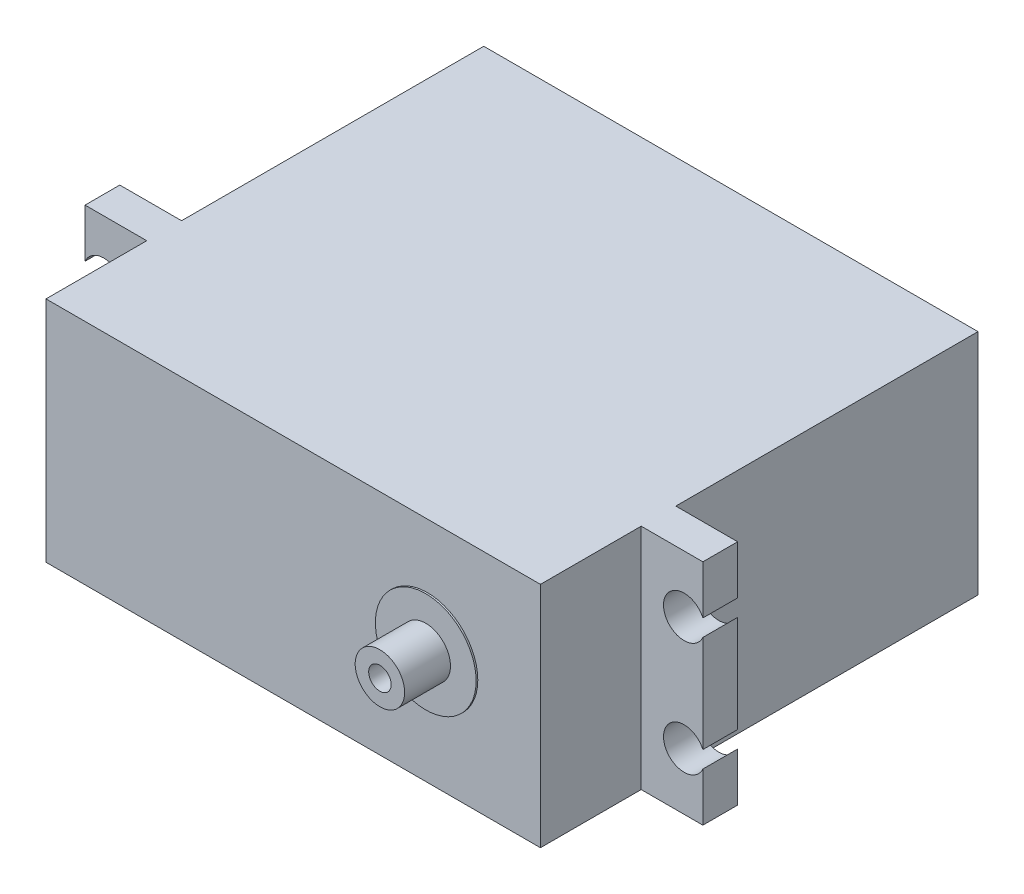
ISO-10303-21;
HEADER;
FILE_DESCRIPTION(('STEP AP214'),'2;1');
FILE_NAME('part.step','',(''),(''),'','','');
FILE_SCHEMA(('AUTOMOTIVE_DESIGN { 1 0 10303 214 1 1 1 1 }'));
ENDSEC;
DATA;
#1=APPLICATION_CONTEXT('core data for automotive mechanical design processes');
#2=APPLICATION_PROTOCOL_DEFINITION('international standard','automotive_design',2000,#1);
#3=PRODUCT_CONTEXT('',#1,'mechanical');
#4=PRODUCT('Part','Part','',(#3));
#5=PRODUCT_RELATED_PRODUCT_CATEGORY('part','',(#4));
#6=PRODUCT_DEFINITION_FORMATION('','',#4);
#7=PRODUCT_DEFINITION_CONTEXT('part definition',#1,'design');
#8=PRODUCT_DEFINITION('design','',#6,#7);
#9=PRODUCT_DEFINITION_SHAPE('','',#8);
#10=(LENGTH_UNIT() NAMED_UNIT(*) SI_UNIT(.MILLI.,.METRE.));
#11=(NAMED_UNIT(*) PLANE_ANGLE_UNIT() SI_UNIT($,.RADIAN.));
#12=(NAMED_UNIT(*) SI_UNIT($,.STERADIAN.) SOLID_ANGLE_UNIT());
#13=UNCERTAINTY_MEASURE_WITH_UNIT(LENGTH_MEASURE(1.E-05),#10,'distance_accuracy_value','');
#14=(GEOMETRIC_REPRESENTATION_CONTEXT(3) GLOBAL_UNCERTAINTY_ASSIGNED_CONTEXT((#13)) GLOBAL_UNIT_ASSIGNED_CONTEXT((#10,
#11,#12)) REPRESENTATION_CONTEXT('',''));
#15=CARTESIAN_POINT('',(0.,0.,0.));
#16=DIRECTION('',(0.,0.,1.));
#17=DIRECTION('',(1.,0.,0.));
#18=AXIS2_PLACEMENT_3D('',#15,#16,#17);
#19=CARTESIAN_POINT('',(0.,0.,45.0154));
#20=DIRECTION('',(0.,0.,1.));
#21=DIRECTION('',(1.,0.,0.));
#22=AXIS2_PLACEMENT_3D('',#19,#20,#21);
#23=PLANE('',#22);
#24=DIRECTION('',(0.,-1.,0.));
#25=VECTOR('',#24,1.);
#26=CARTESIAN_POINT('',(-33.03236,-15.24,45.0154));
#27=LINE('',#26,#25);
#28=CARTESIAN_POINT('',(-33.03236,15.24,45.0154));
#29=VERTEX_POINT('',#28);
#30=CARTESIAN_POINT('',(-33.03236,-15.24,45.0154));
#31=VERTEX_POINT('',#30);
#32=EDGE_CURVE('E194',#29,#31,#27,.T.);
#33=ORIENTED_EDGE('',*,*,#32,.F.);
#34=DIRECTION('',(-1.,0.,0.));
#35=VECTOR('',#34,1.);
#36=CARTESIAN_POINT('',(0.,15.24,45.0154));
#37=LINE('',#36,#35);
#38=CARTESIAN_POINT('',(-41.275,15.24,45.0154));
#39=VERTEX_POINT('',#38);
#40=EDGE_CURVE('E505',#29,#39,#37,.T.);
#41=ORIENTED_EDGE('',*,*,#40,.T.);
#42=DIRECTION('',(0.,1.,0.));
#43=VECTOR('',#42,1.);
#44=CARTESIAN_POINT('',(-41.275,0.,45.0154));
#45=LINE('',#44,#43);
#46=CARTESIAN_POINT('',(-41.275,8.74168445002051,45.0154));
#47=VERTEX_POINT('',#46);
#48=EDGE_CURVE('E513',#47,#39,#45,.T.);
#49=ORIENTED_EDGE('',*,*,#48,.F.);
#50=CARTESIAN_POINT('',(-38.76612,7.61562,45.0154));
#51=DIRECTION('',(0.,0.,1.));
#52=DIRECTION('',(1.,0.,0.));
#53=AXIS2_PLACEMENT_3D('',#50,#51,#52);
#54=CIRCLE('',#53,2.75);
#55=CARTESIAN_POINT('',(-41.275,6.48955554997949,45.0154));
#56=VERTEX_POINT('',#55);
#57=EDGE_CURVE('E525',#47,#56,#54,.F.);
#58=ORIENTED_EDGE('',*,*,#57,.T.);
#59=DIRECTION('',(0.,-1.,0.));
#60=VECTOR('',#59,1.);
#61=CARTESIAN_POINT('',(-41.275,0.,45.0154));
#62=LINE('',#61,#60);
#63=CARTESIAN_POINT('',(-41.275,-6.48955554997949,45.0154));
#64=VERTEX_POINT('',#63);
#65=EDGE_CURVE('E527',#56,#64,#62,.T.);
#66=ORIENTED_EDGE('',*,*,#65,.T.);
#67=CARTESIAN_POINT('',(-38.76612,-7.61562,45.0154));
#68=DIRECTION('',(0.,0.,1.));
#69=DIRECTION('',(1.,0.,0.));
#70=AXIS2_PLACEMENT_3D('',#67,#68,#69);
#71=CIRCLE('',#70,2.75);
#72=CARTESIAN_POINT('',(-41.275,-8.74168445002051,45.0154));
#73=VERTEX_POINT('',#72);
#74=EDGE_CURVE('E529',#73,#64,#71,.T.);
#75=ORIENTED_EDGE('',*,*,#74,.F.);
#76=DIRECTION('',(0.,-1.,0.));
#77=VECTOR('',#76,1.);
#78=CARTESIAN_POINT('',(-41.275,0.,45.0154));
#79=LINE('',#78,#77);
#80=CARTESIAN_POINT('',(-41.275,-15.24,45.0154));
#81=VERTEX_POINT('',#80);
#82=EDGE_CURVE('E532',#73,#81,#79,.T.);
#83=ORIENTED_EDGE('',*,*,#82,.T.);
#84=DIRECTION('',(-1.,0.,0.));
#85=VECTOR('',#84,1.);
#86=CARTESIAN_POINT('',(0.,-15.24,45.0154));
#87=LINE('',#86,#85);
#88=EDGE_CURVE('E50',#31,#81,#87,.T.);
#89=ORIENTED_EDGE('',*,*,#88,.F.);
#90=EDGE_LOOP('',(#33,#41,#49,#58,#66,#75,#83,#89));
#91=FACE_BOUND('',#90,.T.);
#92=ADVANCED_FACE('F35',(#91),#23,.T.);
#93=CARTESIAN_POINT('',(-33.02,-15.24,40.3754));
#94=DIRECTION('',(1.,0.,0.));
#95=DIRECTION('',(0.,0.,-1.));
#96=AXIS2_PLACEMENT_3D('',#93,#94,#95);
#97=PLANE('',#96);
#98=DIRECTION('',(0.,-1.,0.));
#99=VECTOR('',#98,1.);
#100=CARTESIAN_POINT('',(-33.02,-15.24,0.));
#101=LINE('',#100,#99);
#102=CARTESIAN_POINT('',(-33.02,15.24,0.));
#103=VERTEX_POINT('',#102);
#104=CARTESIAN_POINT('',(-33.02,-15.24,0.));
#105=VERTEX_POINT('',#104);
#106=EDGE_CURVE('E593',#103,#105,#101,.T.);
#107=ORIENTED_EDGE('',*,*,#106,.T.);
#108=DIRECTION('',(0.,0.,-1.));
#109=VECTOR('',#108,1.);
#110=CARTESIAN_POINT('',(-33.02,-15.24,40.3754));
#111=LINE('',#110,#109);
#112=CARTESIAN_POINT('',(-33.02,-15.24,40.3754));
#113=VERTEX_POINT('',#112);
#114=EDGE_CURVE('E43',#113,#105,#111,.T.);
#115=ORIENTED_EDGE('',*,*,#114,.F.);
#116=DIRECTION('',(0.,-1.,0.));
#117=VECTOR('',#116,1.);
#118=CARTESIAN_POINT('',(-33.02,-15.24,40.3754));
#119=LINE('',#118,#117);
#120=CARTESIAN_POINT('',(-33.02,15.24,40.3754));
#121=VERTEX_POINT('',#120);
#122=EDGE_CURVE('E609',#121,#113,#119,.T.);
#123=ORIENTED_EDGE('',*,*,#122,.F.);
#124=DIRECTION('',(0.,0.,-1.));
#125=VECTOR('',#124,1.);
#126=CARTESIAN_POINT('',(-33.02,15.24,40.3754));
#127=LINE('',#126,#125);
#128=EDGE_CURVE('E614',#121,#103,#127,.T.);
#129=ORIENTED_EDGE('',*,*,#128,.T.);
#130=EDGE_LOOP('',(#107,#115,#123,#129));
#131=FACE_BOUND('',#130,.T.);
#132=ADVANCED_FACE('F37',(#131),#97,.F.);
#133=CARTESIAN_POINT('',(33.02,-15.24,40.3754));
#134=DIRECTION('',(0.,1.,0.));
#135=DIRECTION('',(-1.,0.,0.));
#136=AXIS2_PLACEMENT_3D('',#133,#134,#135);
#137=PLANE('',#136);
#138=DIRECTION('',(1.,0.,0.));
#139=VECTOR('',#138,1.);
#140=CARTESIAN_POINT('',(33.02,-15.24,0.));
#141=LINE('',#140,#139);
#142=CARTESIAN_POINT('',(33.02,-15.24,0.));
#143=VERTEX_POINT('',#142);
#144=EDGE_CURVE('E597',#105,#143,#141,.T.);
#145=ORIENTED_EDGE('',*,*,#144,.T.);
#146=DIRECTION('',(0.,0.,-1.));
#147=VECTOR('',#146,1.);
#148=CARTESIAN_POINT('',(33.02,-15.24,40.3754));
#149=LINE('',#148,#147);
#150=CARTESIAN_POINT('',(33.02,-15.24,40.3754));
#151=VERTEX_POINT('',#150);
#152=EDGE_CURVE('E613',#151,#143,#149,.T.);
#153=ORIENTED_EDGE('',*,*,#152,.F.);
#154=DIRECTION('',(-1.,0.,0.));
#155=VECTOR('',#154,1.);
#156=CARTESIAN_POINT('',(0.,-15.24,40.3754));
#157=LINE('',#156,#155);
#158=CARTESIAN_POINT('',(41.275,-15.24,40.3754));
#159=VERTEX_POINT('',#158);
#160=EDGE_CURVE('E561',#159,#151,#157,.T.);
#161=ORIENTED_EDGE('',*,*,#160,.F.);
#162=DIRECTION('',(0.,0.,-1.));
#163=VECTOR('',#162,1.);
#164=CARTESIAN_POINT('',(41.275,-15.24,45.0154));
#165=LINE('',#164,#163);
#166=CARTESIAN_POINT('',(41.275,-15.24,45.0154));
#167=VERTEX_POINT('',#166);
#168=EDGE_CURVE('E568',#167,#159,#165,.T.);
#169=ORIENTED_EDGE('',*,*,#168,.F.);
#170=CARTESIAN_POINT('',(33.03236,-15.24,45.0154));
#171=VERTEX_POINT('',#170);
#172=EDGE_CURVE('E519',#167,#171,#87,.T.);
#173=ORIENTED_EDGE('',*,*,#172,.T.);
#174=DIRECTION('',(0.,0.,-1.));
#175=VECTOR('',#174,1.);
#176=CARTESIAN_POINT('',(33.03236,-15.24,58.4774));
#177=LINE('',#176,#175);
#178=CARTESIAN_POINT('',(33.03236,-15.24,58.4774));
#179=VERTEX_POINT('',#178);
#180=EDGE_CURVE('E179',#179,#171,#177,.T.);
#181=ORIENTED_EDGE('',*,*,#180,.F.);
#182=DIRECTION('',(1.,0.,0.));
#183=VECTOR('',#182,1.);
#184=CARTESIAN_POINT('',(33.03236,-15.24,58.4774));
#185=LINE('',#184,#183);
#186=CARTESIAN_POINT('',(-33.03236,-15.24,58.4774));
#187=VERTEX_POINT('',#186);
#188=EDGE_CURVE('E172',#187,#179,#185,.T.);
#189=ORIENTED_EDGE('',*,*,#188,.F.);
#190=DIRECTION('',(0.,0.,-1.));
#191=VECTOR('',#190,1.);
#192=CARTESIAN_POINT('',(-33.03236,-15.24,58.4774));
#193=LINE('',#192,#191);
#194=EDGE_CURVE('E176',#187,#31,#193,.T.);
#195=ORIENTED_EDGE('',*,*,#194,.T.);
#196=ORIENTED_EDGE('',*,*,#88,.T.);
#197=DIRECTION('',(0.,0.,-1.));
#198=VECTOR('',#197,1.);
#199=CARTESIAN_POINT('',(-41.275,-15.24,45.0154));
#200=LINE('',#199,#198);
#201=CARTESIAN_POINT('',(-41.275,-15.24,40.3754));
#202=VERTEX_POINT('',#201);
#203=EDGE_CURVE('E571',#81,#202,#200,.T.);
#204=ORIENTED_EDGE('',*,*,#203,.T.);
#205=EDGE_CURVE('E558',#113,#202,#157,.T.);
#206=ORIENTED_EDGE('',*,*,#205,.F.);
#207=ORIENTED_EDGE('',*,*,#114,.T.);
#208=EDGE_LOOP('',(#145,#153,#161,#169,#173,#181,#189,#195,#196,#204,#206,#207));
#209=FACE_BOUND('',#208,.T.);
#210=ADVANCED_FACE('F174',(#209),#137,.F.);
#211=CARTESIAN_POINT('',(33.02,-15.24,40.3754));
#212=DIRECTION('',(-1.,0.,0.));
#213=DIRECTION('',(0.,0.,1.));
#214=AXIS2_PLACEMENT_3D('',#211,#212,#213);
#215=PLANE('',#214);
#216=DIRECTION('',(0.,1.,0.));
#217=VECTOR('',#216,1.);
#218=CARTESIAN_POINT('',(33.02,-15.24,0.));
#219=LINE('',#218,#217);
#220=CARTESIAN_POINT('',(33.02,15.24,0.));
#221=VERTEX_POINT('',#220);
#222=EDGE_CURVE('E601',#143,#221,#219,.T.);
#223=ORIENTED_EDGE('',*,*,#222,.T.);
#224=DIRECTION('',(0.,0.,-1.));
#225=VECTOR('',#224,1.);
#226=CARTESIAN_POINT('',(33.02,15.24,40.3754));
#227=LINE('',#226,#225);
#228=CARTESIAN_POINT('',(33.02,15.24,40.3754));
#229=VERTEX_POINT('',#228);
#230=EDGE_CURVE('E610',#229,#221,#227,.T.);
#231=ORIENTED_EDGE('',*,*,#230,.F.);
#232=DIRECTION('',(0.,1.,0.));
#233=VECTOR('',#232,1.);
#234=CARTESIAN_POINT('',(33.02,-15.24,40.3754));
#235=LINE('',#234,#233);
#236=EDGE_CURVE('E617',#151,#229,#235,.T.);
#237=ORIENTED_EDGE('',*,*,#236,.F.);
#238=ORIENTED_EDGE('',*,*,#152,.T.);
#239=EDGE_LOOP('',(#223,#231,#237,#238));
#240=FACE_BOUND('',#239,.T.);
#241=ADVANCED_FACE('F332',(#240),#215,.F.);
#242=CARTESIAN_POINT('',(33.02,15.24,40.3754));
#243=DIRECTION('',(0.,-1.,0.));
#244=DIRECTION('',(1.,0.,0.));
#245=AXIS2_PLACEMENT_3D('',#242,#243,#244);
#246=PLANE('',#245);
#247=DIRECTION('',(-1.,0.,0.));
#248=VECTOR('',#247,1.);
#249=CARTESIAN_POINT('',(33.02,15.24,0.));
#250=LINE('',#249,#248);
#251=EDGE_CURVE('E607',#221,#103,#250,.T.);
#252=ORIENTED_EDGE('',*,*,#251,.T.);
#253=ORIENTED_EDGE('',*,*,#128,.F.);
#254=DIRECTION('',(-1.,0.,0.));
#255=VECTOR('',#254,1.);
#256=CARTESIAN_POINT('',(0.,15.24,40.3754));
#257=LINE('',#256,#255);
#258=CARTESIAN_POINT('',(-41.275,15.24,40.3754));
#259=VERTEX_POINT('',#258);
#260=EDGE_CURVE('E546',#121,#259,#257,.T.);
#261=ORIENTED_EDGE('',*,*,#260,.T.);
#262=DIRECTION('',(0.,0.,-1.));
#263=VECTOR('',#262,1.);
#264=CARTESIAN_POINT('',(-41.275,15.24,45.0154));
#265=LINE('',#264,#263);
#266=EDGE_CURVE('E507',#39,#259,#265,.T.);
#267=ORIENTED_EDGE('',*,*,#266,.F.);
#268=ORIENTED_EDGE('',*,*,#40,.F.);
#269=DIRECTION('',(0.,0.,-1.));
#270=VECTOR('',#269,1.);
#271=CARTESIAN_POINT('',(-33.03236,15.24,58.4774));
#272=LINE('',#271,#270);
#273=CARTESIAN_POINT('',(-33.03236,15.24,58.4774));
#274=VERTEX_POINT('',#273);
#275=EDGE_CURVE('E210',#274,#29,#272,.T.);
#276=ORIENTED_EDGE('',*,*,#275,.F.);
#277=DIRECTION('',(-1.,0.,0.));
#278=VECTOR('',#277,1.);
#279=CARTESIAN_POINT('',(33.03236,15.24,58.4774));
#280=LINE('',#279,#278);
#281=CARTESIAN_POINT('',(33.03236,15.24,58.4774));
#282=VERTEX_POINT('',#281);
#283=EDGE_CURVE('E188',#282,#274,#280,.T.);
#284=ORIENTED_EDGE('',*,*,#283,.F.);
#285=DIRECTION('',(0.,0.,-1.));
#286=VECTOR('',#285,1.);
#287=CARTESIAN_POINT('',(33.03236,15.24,58.4774));
#288=LINE('',#287,#286);
#289=CARTESIAN_POINT('',(33.03236,15.24,45.0154));
#290=VERTEX_POINT('',#289);
#291=EDGE_CURVE('E200',#282,#290,#288,.T.);
#292=ORIENTED_EDGE('',*,*,#291,.T.);
#293=CARTESIAN_POINT('',(41.275,15.24,45.0154));
#294=VERTEX_POINT('',#293);
#295=EDGE_CURVE('E510',#294,#290,#37,.T.);
#296=ORIENTED_EDGE('',*,*,#295,.F.);
#297=DIRECTION('',(0.,0.,-1.));
#298=VECTOR('',#297,1.);
#299=CARTESIAN_POINT('',(41.275,15.24,45.0154));
#300=LINE('',#299,#298);
#301=CARTESIAN_POINT('',(41.275,15.24,40.3754));
#302=VERTEX_POINT('',#301);
#303=EDGE_CURVE('E584',#294,#302,#300,.T.);
#304=ORIENTED_EDGE('',*,*,#303,.T.);
#305=EDGE_CURVE('E555',#302,#229,#257,.T.);
#306=ORIENTED_EDGE('',*,*,#305,.T.);
#307=ORIENTED_EDGE('',*,*,#230,.T.);
#308=EDGE_LOOP('',(#252,#253,#261,#267,#268,#276,#284,#292,#296,#304,#306,#307));
#309=FACE_BOUND('',#308,.T.);
#310=ADVANCED_FACE('F328',(#309),#246,.F.);
#311=CARTESIAN_POINT('',(0.,0.,0.));
#312=DIRECTION('',(0.,0.,1.));
#313=DIRECTION('',(1.,0.,0.));
#314=AXIS2_PLACEMENT_3D('',#311,#312,#313);
#315=PLANE('',#314);
#316=ORIENTED_EDGE('',*,*,#106,.F.);
#317=ORIENTED_EDGE('',*,*,#251,.F.);
#318=ORIENTED_EDGE('',*,*,#222,.F.);
#319=ORIENTED_EDGE('',*,*,#144,.F.);
#320=EDGE_LOOP('',(#316,#317,#318,#319));
#321=FACE_BOUND('',#320,.T.);
#322=ADVANCED_FACE('F325',(#321),#315,.F.);
#323=CARTESIAN_POINT('',(0.,0.,40.3754));
#324=DIRECTION('',(0.,0.,1.));
#325=DIRECTION('',(1.,0.,0.));
#326=AXIS2_PLACEMENT_3D('',#323,#324,#325);
#327=PLANE('',#326);
#328=ORIENTED_EDGE('',*,*,#260,.F.);
#329=ORIENTED_EDGE('',*,*,#122,.T.);
#330=ORIENTED_EDGE('',*,*,#205,.T.);
#331=DIRECTION('',(0.,-1.,0.));
#332=VECTOR('',#331,1.);
#333=CARTESIAN_POINT('',(-41.275,0.,40.3754));
#334=LINE('',#333,#332);
#335=CARTESIAN_POINT('',(-41.275,-8.74168445002051,40.3754));
#336=VERTEX_POINT('',#335);
#337=EDGE_CURVE('E562',#336,#202,#334,.T.);
#338=ORIENTED_EDGE('',*,*,#337,.F.);
#339=CARTESIAN_POINT('',(-38.76612,-7.61562,40.3754));
#340=DIRECTION('',(0.,0.,1.));
#341=DIRECTION('',(1.,0.,0.));
#342=AXIS2_PLACEMENT_3D('',#339,#340,#341);
#343=CIRCLE('',#342,2.75);
#344=CARTESIAN_POINT('',(-41.275,-6.48955554997949,40.3754));
#345=VERTEX_POINT('',#344);
#346=EDGE_CURVE('E674',#336,#345,#343,.T.);
#347=ORIENTED_EDGE('',*,*,#346,.T.);
#348=DIRECTION('',(0.,-1.,0.));
#349=VECTOR('',#348,1.);
#350=CARTESIAN_POINT('',(-41.275,0.,40.3754));
#351=LINE('',#350,#349);
#352=CARTESIAN_POINT('',(-41.275,6.48955554997949,40.3754));
#353=VERTEX_POINT('',#352);
#354=EDGE_CURVE('E649',#353,#345,#351,.T.);
#355=ORIENTED_EDGE('',*,*,#354,.F.);
#356=CARTESIAN_POINT('',(-38.76612,7.61562,40.3754));
#357=DIRECTION('',(0.,0.,1.));
#358=DIRECTION('',(1.,0.,0.));
#359=AXIS2_PLACEMENT_3D('',#356,#357,#358);
#360=CIRCLE('',#359,2.75);
#361=CARTESIAN_POINT('',(-41.275,8.74168445002051,40.3754));
#362=VERTEX_POINT('',#361);
#363=EDGE_CURVE('E646',#362,#353,#360,.F.);
#364=ORIENTED_EDGE('',*,*,#363,.F.);
#365=DIRECTION('',(0.,1.,0.));
#366=VECTOR('',#365,1.);
#367=CARTESIAN_POINT('',(-41.275,0.,40.3754));
#368=LINE('',#367,#366);
#369=EDGE_CURVE('E549',#362,#259,#368,.T.);
#370=ORIENTED_EDGE('',*,*,#369,.T.);
#371=EDGE_LOOP('',(#328,#329,#330,#338,#347,#355,#364,#370));
#372=FACE_BOUND('',#371,.T.);
#373=ADVANCED_FACE('F291',(#372),#327,.F.);
#374=ORIENTED_EDGE('',*,*,#160,.T.);
#375=ORIENTED_EDGE('',*,*,#236,.T.);
#376=ORIENTED_EDGE('',*,*,#305,.F.);
#377=DIRECTION('',(0.,1.,0.));
#378=VECTOR('',#377,1.);
#379=CARTESIAN_POINT('',(41.275,0.,40.3754));
#380=LINE('',#379,#378);
#381=CARTESIAN_POINT('',(41.275,8.7416844500205,40.3754));
#382=VERTEX_POINT('',#381);
#383=EDGE_CURVE('E544',#382,#302,#380,.T.);
#384=ORIENTED_EDGE('',*,*,#383,.F.);
#385=CARTESIAN_POINT('',(38.76612,7.61562000000001,40.3754));
#386=DIRECTION('',(0.,0.,1.));
#387=DIRECTION('',(1.,0.,0.));
#388=AXIS2_PLACEMENT_3D('',#385,#386,#387);
#389=CIRCLE('',#388,2.75);
#390=CARTESIAN_POINT('',(41.275,6.4895555499795,40.3754));
#391=VERTEX_POINT('',#390);
#392=EDGE_CURVE('E541',#382,#391,#389,.T.);
#393=ORIENTED_EDGE('',*,*,#392,.T.);
#394=DIRECTION('',(0.,-1.,0.));
#395=VECTOR('',#394,1.);
#396=CARTESIAN_POINT('',(41.275,0.,40.3754));
#397=LINE('',#396,#395);
#398=CARTESIAN_POINT('',(41.275,-6.4895555499795,40.3754));
#399=VERTEX_POINT('',#398);
#400=EDGE_CURVE('E538',#391,#399,#397,.T.);
#401=ORIENTED_EDGE('',*,*,#400,.T.);
#402=CARTESIAN_POINT('',(38.76612,-7.61562000000001,40.3754));
#403=DIRECTION('',(0.,0.,1.));
#404=DIRECTION('',(1.,0.,0.));
#405=AXIS2_PLACEMENT_3D('',#402,#403,#404);
#406=CIRCLE('',#405,2.75);
#407=CARTESIAN_POINT('',(41.275,-8.7416844500205,40.3754));
#408=VERTEX_POINT('',#407);
#409=EDGE_CURVE('E198',#408,#399,#406,.F.);
#410=ORIENTED_EDGE('',*,*,#409,.F.);
#411=DIRECTION('',(0.,-1.,0.));
#412=VECTOR('',#411,1.);
#413=CARTESIAN_POINT('',(41.275,0.,40.3754));
#414=LINE('',#413,#412);
#415=EDGE_CURVE('E195',#408,#159,#414,.T.);
#416=ORIENTED_EDGE('',*,*,#415,.T.);
#417=EDGE_LOOP('',(#374,#375,#376,#384,#393,#401,#410,#416));
#418=FACE_BOUND('',#417,.T.);
#419=ADVANCED_FACE('F323',(#418),#327,.F.);
#420=CARTESIAN_POINT('',(41.275,0.,45.0154));
#421=DIRECTION('',(1.,0.,0.));
#422=DIRECTION('',(0.,0.,-1.));
#423=AXIS2_PLACEMENT_3D('',#420,#421,#422);
#424=PLANE('',#423);
#425=ORIENTED_EDGE('',*,*,#415,.F.);
#426=DIRECTION('',(0.,0.,-1.));
#427=VECTOR('',#426,1.);
#428=CARTESIAN_POINT('',(41.275,-8.7416844500205,45.0154));
#429=LINE('',#428,#427);
#430=CARTESIAN_POINT('',(41.275,-8.7416844500205,45.0154));
#431=VERTEX_POINT('',#430);
#432=EDGE_CURVE('E592',#431,#408,#429,.T.);
#433=ORIENTED_EDGE('',*,*,#432,.F.);
#434=DIRECTION('',(0.,-1.,0.));
#435=VECTOR('',#434,1.);
#436=CARTESIAN_POINT('',(41.275,0.,45.0154));
#437=LINE('',#436,#435);
#438=EDGE_CURVE('E217',#431,#167,#437,.T.);
#439=ORIENTED_EDGE('',*,*,#438,.T.);
#440=ORIENTED_EDGE('',*,*,#168,.T.);
#441=EDGE_LOOP('',(#425,#433,#439,#440));
#442=FACE_BOUND('',#441,.T.);
#443=ADVANCED_FACE('F319',(#442),#424,.T.);
#444=CARTESIAN_POINT('',(38.76612,-7.61562000000001,45.0154));
#445=DIRECTION('',(0.,0.,-1.));
#446=DIRECTION('',(-1.,0.,0.));
#447=AXIS2_PLACEMENT_3D('',#444,#445,#446);
#448=CYLINDRICAL_SURFACE('',#447,2.75);
#449=ORIENTED_EDGE('',*,*,#409,.T.);
#450=DIRECTION('',(0.,0.,-1.));
#451=VECTOR('',#450,1.);
#452=CARTESIAN_POINT('',(41.275,-6.4895555499795,45.0154));
#453=LINE('',#452,#451);
#454=CARTESIAN_POINT('',(41.275,-6.4895555499795,45.0154));
#455=VERTEX_POINT('',#454);
#456=EDGE_CURVE('E591',#455,#399,#453,.T.);
#457=ORIENTED_EDGE('',*,*,#456,.F.);
#458=CARTESIAN_POINT('',(38.76612,-7.61562000000001,45.0154));
#459=DIRECTION('',(0.,0.,1.));
#460=DIRECTION('',(1.,0.,0.));
#461=AXIS2_PLACEMENT_3D('',#458,#459,#460);
#462=CIRCLE('',#461,2.75);
#463=EDGE_CURVE('E658',#431,#455,#462,.F.);
#464=ORIENTED_EDGE('',*,*,#463,.F.);
#465=ORIENTED_EDGE('',*,*,#432,.T.);
#466=EDGE_LOOP('',(#449,#457,#464,#465));
#467=FACE_BOUND('',#466,.T.);
#468=ADVANCED_FACE('F315',(#467),#448,.F.);
#469=CARTESIAN_POINT('',(41.275,0.,45.0154));
#470=DIRECTION('',(1.,0.,0.));
#471=DIRECTION('',(0.,0.,-1.));
#472=AXIS2_PLACEMENT_3D('',#469,#470,#471);
#473=PLANE('',#472);
#474=ORIENTED_EDGE('',*,*,#400,.F.);
#475=DIRECTION('',(0.,0.,-1.));
#476=VECTOR('',#475,1.);
#477=CARTESIAN_POINT('',(41.275,6.4895555499795,45.0154));
#478=LINE('',#477,#476);
#479=CARTESIAN_POINT('',(41.275,6.4895555499795,45.0154));
#480=VERTEX_POINT('',#479);
#481=EDGE_CURVE('E589',#480,#391,#478,.T.);
#482=ORIENTED_EDGE('',*,*,#481,.F.);
#483=DIRECTION('',(0.,-1.,0.));
#484=VECTOR('',#483,1.);
#485=CARTESIAN_POINT('',(41.275,0.,45.0154));
#486=LINE('',#485,#484);
#487=EDGE_CURVE('E660',#480,#455,#486,.T.);
#488=ORIENTED_EDGE('',*,*,#487,.T.);
#489=ORIENTED_EDGE('',*,*,#456,.T.);
#490=EDGE_LOOP('',(#474,#482,#488,#489));
#491=FACE_BOUND('',#490,.T.);
#492=ADVANCED_FACE('F311',(#491),#473,.T.);
#493=CARTESIAN_POINT('',(38.76612,7.61562000000001,45.0154));
#494=DIRECTION('',(0.,0.,-1.));
#495=DIRECTION('',(-1.,0.,0.));
#496=AXIS2_PLACEMENT_3D('',#493,#494,#495);
#497=CYLINDRICAL_SURFACE('',#496,2.75);
#498=ORIENTED_EDGE('',*,*,#392,.F.);
#499=DIRECTION('',(0.,0.,-1.));
#500=VECTOR('',#499,1.);
#501=CARTESIAN_POINT('',(41.275,8.7416844500205,45.0154));
#502=LINE('',#501,#500);
#503=CARTESIAN_POINT('',(41.275,8.7416844500205,45.0154));
#504=VERTEX_POINT('',#503);
#505=EDGE_CURVE('E587',#504,#382,#502,.T.);
#506=ORIENTED_EDGE('',*,*,#505,.F.);
#507=CARTESIAN_POINT('',(38.76612,7.61562000000001,45.0154));
#508=DIRECTION('',(0.,0.,1.));
#509=DIRECTION('',(1.,0.,0.));
#510=AXIS2_PLACEMENT_3D('',#507,#508,#509);
#511=CIRCLE('',#510,2.75);
#512=EDGE_CURVE('E515',#504,#480,#511,.T.);
#513=ORIENTED_EDGE('',*,*,#512,.T.);
#514=ORIENTED_EDGE('',*,*,#481,.T.);
#515=EDGE_LOOP('',(#498,#506,#513,#514));
#516=FACE_BOUND('',#515,.T.);
#517=ADVANCED_FACE('F307',(#516),#497,.F.);
#518=CARTESIAN_POINT('',(41.275,0.,45.0154));
#519=DIRECTION('',(-1.,0.,0.));
#520=DIRECTION('',(0.,0.,1.));
#521=AXIS2_PLACEMENT_3D('',#518,#519,#520);
#522=PLANE('',#521);
#523=ORIENTED_EDGE('',*,*,#383,.T.);
#524=ORIENTED_EDGE('',*,*,#303,.F.);
#525=DIRECTION('',(0.,1.,0.));
#526=VECTOR('',#525,1.);
#527=CARTESIAN_POINT('',(41.275,0.,45.0154));
#528=LINE('',#527,#526);
#529=EDGE_CURVE('E511',#504,#294,#528,.T.);
#530=ORIENTED_EDGE('',*,*,#529,.F.);
#531=ORIENTED_EDGE('',*,*,#505,.T.);
#532=EDGE_LOOP('',(#523,#524,#530,#531));
#533=FACE_BOUND('',#532,.T.);
#534=ADVANCED_FACE('F303',(#533),#522,.F.);
#535=CARTESIAN_POINT('',(-41.275,0.,45.0154));
#536=DIRECTION('',(-1.,0.,0.));
#537=DIRECTION('',(0.,0.,1.));
#538=AXIS2_PLACEMENT_3D('',#535,#536,#537);
#539=PLANE('',#538);
#540=ORIENTED_EDGE('',*,*,#369,.F.);
#541=DIRECTION('',(0.,0.,-1.));
#542=VECTOR('',#541,1.);
#543=CARTESIAN_POINT('',(-41.275,8.74168445002051,45.0154));
#544=LINE('',#543,#542);
#545=EDGE_CURVE('E581',#47,#362,#544,.T.);
#546=ORIENTED_EDGE('',*,*,#545,.F.);
#547=ORIENTED_EDGE('',*,*,#48,.T.);
#548=ORIENTED_EDGE('',*,*,#266,.T.);
#549=EDGE_LOOP('',(#540,#546,#547,#548));
#550=FACE_BOUND('',#549,.T.);
#551=ADVANCED_FACE('F299',(#550),#539,.T.);
#552=CARTESIAN_POINT('',(-38.76612,7.61562,45.0154));
#553=DIRECTION('',(0.,0.,-1.));
#554=DIRECTION('',(-1.,0.,0.));
#555=AXIS2_PLACEMENT_3D('',#552,#553,#554);
#556=CYLINDRICAL_SURFACE('',#555,2.75);
#557=ORIENTED_EDGE('',*,*,#363,.T.);
#558=DIRECTION('',(0.,0.,-1.));
#559=VECTOR('',#558,1.);
#560=CARTESIAN_POINT('',(-41.275,6.48955554997949,45.0154));
#561=LINE('',#560,#559);
#562=EDGE_CURVE('E578',#56,#353,#561,.T.);
#563=ORIENTED_EDGE('',*,*,#562,.F.);
#564=ORIENTED_EDGE('',*,*,#57,.F.);
#565=ORIENTED_EDGE('',*,*,#545,.T.);
#566=EDGE_LOOP('',(#557,#563,#564,#565));
#567=FACE_BOUND('',#566,.T.);
#568=ADVANCED_FACE('F295',(#567),#556,.F.);
#569=CARTESIAN_POINT('',(-41.275,0.,45.0154));
#570=DIRECTION('',(1.,0.,0.));
#571=DIRECTION('',(0.,0.,-1.));
#572=AXIS2_PLACEMENT_3D('',#569,#570,#571);
#573=PLANE('',#572);
#574=ORIENTED_EDGE('',*,*,#354,.T.);
#575=DIRECTION('',(0.,0.,-1.));
#576=VECTOR('',#575,1.);
#577=CARTESIAN_POINT('',(-41.275,-6.48955554997949,45.0154));
#578=LINE('',#577,#576);
#579=EDGE_CURVE('E576',#64,#345,#578,.T.);
#580=ORIENTED_EDGE('',*,*,#579,.F.);
#581=ORIENTED_EDGE('',*,*,#65,.F.);
#582=ORIENTED_EDGE('',*,*,#562,.T.);
#583=EDGE_LOOP('',(#574,#580,#581,#582));
#584=FACE_BOUND('',#583,.T.);
#585=ADVANCED_FACE('F287',(#584),#573,.F.);
#586=CARTESIAN_POINT('',(-38.76612,-7.61562,45.0154));
#587=DIRECTION('',(0.,0.,-1.));
#588=DIRECTION('',(-1.,0.,0.));
#589=AXIS2_PLACEMENT_3D('',#586,#587,#588);
#590=CYLINDRICAL_SURFACE('',#589,2.75);
#591=ORIENTED_EDGE('',*,*,#346,.F.);
#592=DIRECTION('',(0.,0.,-1.));
#593=VECTOR('',#592,1.);
#594=CARTESIAN_POINT('',(-41.275,-8.74168445002051,45.0154));
#595=LINE('',#594,#593);
#596=EDGE_CURVE('E574',#73,#336,#595,.T.);
#597=ORIENTED_EDGE('',*,*,#596,.F.);
#598=ORIENTED_EDGE('',*,*,#74,.T.);
#599=ORIENTED_EDGE('',*,*,#579,.T.);
#600=EDGE_LOOP('',(#591,#597,#598,#599));
#601=FACE_BOUND('',#600,.T.);
#602=ADVANCED_FACE('F281',(#601),#590,.F.);
#603=CARTESIAN_POINT('',(-41.275,0.,45.0154));
#604=DIRECTION('',(1.,0.,0.));
#605=DIRECTION('',(0.,0.,-1.));
#606=AXIS2_PLACEMENT_3D('',#603,#604,#605);
#607=PLANE('',#606);
#608=ORIENTED_EDGE('',*,*,#337,.T.);
#609=ORIENTED_EDGE('',*,*,#203,.F.);
#610=ORIENTED_EDGE('',*,*,#82,.F.);
#611=ORIENTED_EDGE('',*,*,#596,.T.);
#612=EDGE_LOOP('',(#608,#609,#610,#611));
#613=FACE_BOUND('',#612,.T.);
#614=ADVANCED_FACE('F275',(#613),#607,.F.);
#615=DIRECTION('',(0.,1.,0.));
#616=VECTOR('',#615,1.);
#617=CARTESIAN_POINT('',(33.03236,-15.24,45.0154));
#618=LINE('',#617,#616);
#619=EDGE_CURVE('E58',#171,#290,#618,.T.);
#620=ORIENTED_EDGE('',*,*,#619,.F.);
#621=ORIENTED_EDGE('',*,*,#172,.F.);
#622=ORIENTED_EDGE('',*,*,#438,.F.);
#623=ORIENTED_EDGE('',*,*,#463,.T.);
#624=ORIENTED_EDGE('',*,*,#487,.F.);
#625=ORIENTED_EDGE('',*,*,#512,.F.);
#626=ORIENTED_EDGE('',*,*,#529,.T.);
#627=ORIENTED_EDGE('',*,*,#295,.T.);
#628=EDGE_LOOP('',(#620,#621,#622,#623,#624,#625,#626,#627));
#629=FACE_BOUND('',#628,.T.);
#630=ADVANCED_FACE('F267',(#629),#23,.T.);
#631=CARTESIAN_POINT('',(-33.03236,-15.24,58.4774));
#632=DIRECTION('',(1.,0.,0.));
#633=DIRECTION('',(0.,0.,-1.));
#634=AXIS2_PLACEMENT_3D('',#631,#632,#633);
#635=PLANE('',#634);
#636=ORIENTED_EDGE('',*,*,#32,.T.);
#637=ORIENTED_EDGE('',*,*,#194,.F.);
#638=DIRECTION('',(0.,-1.,0.));
#639=VECTOR('',#638,1.);
#640=CARTESIAN_POINT('',(-33.03236,-15.24,58.4774));
#641=LINE('',#640,#639);
#642=EDGE_CURVE('E183',#274,#187,#641,.T.);
#643=ORIENTED_EDGE('',*,*,#642,.F.);
#644=ORIENTED_EDGE('',*,*,#275,.T.);
#645=EDGE_LOOP('',(#636,#637,#643,#644));
#646=FACE_BOUND('',#645,.T.);
#647=ADVANCED_FACE('F193',(#646),#635,.F.);
#648=CARTESIAN_POINT('',(33.03236,-15.24,58.4774));
#649=DIRECTION('',(-1.,0.,0.));
#650=DIRECTION('',(0.,0.,1.));
#651=AXIS2_PLACEMENT_3D('',#648,#649,#650);
#652=PLANE('',#651);
#653=ORIENTED_EDGE('',*,*,#619,.T.);
#654=ORIENTED_EDGE('',*,*,#291,.F.);
#655=DIRECTION('',(0.,1.,0.));
#656=VECTOR('',#655,1.);
#657=CARTESIAN_POINT('',(33.03236,-15.24,58.4774));
#658=LINE('',#657,#656);
#659=EDGE_CURVE('E182',#179,#282,#658,.T.);
#660=ORIENTED_EDGE('',*,*,#659,.F.);
#661=ORIENTED_EDGE('',*,*,#180,.T.);
#662=EDGE_LOOP('',(#653,#654,#660,#661));
#663=FACE_BOUND('',#662,.T.);
#664=ADVANCED_FACE('F280',(#663),#652,.F.);
#665=CARTESIAN_POINT('',(0.,0.,58.4774));
#666=DIRECTION('',(0.,0.,1.));
#667=DIRECTION('',(1.,0.,0.));
#668=AXIS2_PLACEMENT_3D('',#665,#666,#667);
#669=PLANE('',#668);
#670=CARTESIAN_POINT('',(17.9325,0.,58.4774));
#671=DIRECTION('',(0.,0.,1.));
#672=DIRECTION('',(1.,0.,0.));
#673=AXIS2_PLACEMENT_3D('',#670,#671,#672);
#674=CIRCLE('',#673,6.731);
#675=CARTESIAN_POINT('',(24.6635,0.,58.4774));
#676=VERTEX_POINT('',#675);
#677=EDGE_CURVE('E231',#676,#676,#674,.T.);
#678=ORIENTED_EDGE('',*,*,#677,.F.);
#679=EDGE_LOOP('',(#678));
#680=FACE_BOUND('',#679,.T.);
#681=ORIENTED_EDGE('',*,*,#642,.T.);
#682=ORIENTED_EDGE('',*,*,#188,.T.);
#683=ORIENTED_EDGE('',*,*,#659,.T.);
#684=ORIENTED_EDGE('',*,*,#283,.T.);
#685=EDGE_LOOP('',(#681,#682,#683,#684));
#686=FACE_BOUND('',#685,.T.);
#687=ADVANCED_FACE('F186',(#680,#686),#669,.T.);
#688=CARTESIAN_POINT('',(17.9325,0.,58.70277));
#689=DIRECTION('',(0.,0.,1.));
#690=DIRECTION('',(1.,0.,0.));
#691=AXIS2_PLACEMENT_3D('',#688,#689,#690);
#692=PLANE('',#691);
#693=CARTESIAN_POINT('',(17.9325,0.,58.70277));
#694=DIRECTION('',(0.,0.,1.));
#695=DIRECTION('',(1.,0.,0.));
#696=AXIS2_PLACEMENT_3D('',#693,#694,#695);
#697=CIRCLE('',#696,6.731);
#698=CARTESIAN_POINT('',(24.6635,0.,58.70277));
#699=VERTEX_POINT('',#698);
#700=EDGE_CURVE('E209',#699,#699,#697,.T.);
#701=ORIENTED_EDGE('',*,*,#700,.T.);
#702=EDGE_LOOP('',(#701));
#703=FACE_BOUND('',#702,.T.);
#704=CARTESIAN_POINT('',(17.9325,0.,58.70277));
#705=DIRECTION('',(0.,0.,1.));
#706=DIRECTION('',(1.,0.,0.));
#707=AXIS2_PLACEMENT_3D('',#704,#705,#706);
#708=CIRCLE('',#707,3.302);
#709=CARTESIAN_POINT('',(21.2345,0.,58.70277));
#710=VERTEX_POINT('',#709);
#711=EDGE_CURVE('E234',#710,#710,#708,.T.);
#712=ORIENTED_EDGE('',*,*,#711,.F.);
#713=EDGE_LOOP('',(#712));
#714=FACE_BOUND('',#713,.T.);
#715=ADVANCED_FACE('F261',(#703,#714),#692,.T.);
#716=CARTESIAN_POINT('',(17.9325,0.,58.70277));
#717=DIRECTION('',(0.,0.,-1.));
#718=DIRECTION('',(-1.,0.,0.));
#719=AXIS2_PLACEMENT_3D('',#716,#717,#718);
#720=CYLINDRICAL_SURFACE('',#719,6.731);
#721=ORIENTED_EDGE('',*,*,#700,.F.);
#722=EDGE_LOOP('',(#721));
#723=FACE_BOUND('',#722,.T.);
#724=ORIENTED_EDGE('',*,*,#677,.T.);
#725=EDGE_LOOP('',(#724));
#726=FACE_BOUND('',#725,.T.);
#727=ADVANCED_FACE('F252',(#723,#726),#720,.T.);
#728=CARTESIAN_POINT('',(17.9325,0.,64.8274));
#729=DIRECTION('',(0.,0.,1.));
#730=DIRECTION('',(1.,0.,0.));
#731=AXIS2_PLACEMENT_3D('',#728,#729,#730);
#732=PLANE('',#731);
#733=CARTESIAN_POINT('',(17.9325,0.,64.8274));
#734=DIRECTION('',(0.,0.,1.));
#735=DIRECTION('',(1.,0.,0.));
#736=AXIS2_PLACEMENT_3D('',#733,#734,#735);
#737=CIRCLE('',#736,3.302);
#738=CARTESIAN_POINT('',(21.2345,0.,64.8274));
#739=VERTEX_POINT('',#738);
#740=EDGE_CURVE('E239',#739,#739,#737,.T.);
#741=ORIENTED_EDGE('',*,*,#740,.T.);
#742=EDGE_LOOP('',(#741));
#743=FACE_BOUND('',#742,.T.);
#744=CARTESIAN_POINT('',(17.9325,0.,64.8274));
#745=DIRECTION('',(0.,0.,1.));
#746=DIRECTION('',(1.,0.,0.));
#747=AXIS2_PLACEMENT_3D('',#744,#745,#746);
#748=CIRCLE('',#747,1.5);
#749=CARTESIAN_POINT('',(19.4325,0.,64.8274));
#750=VERTEX_POINT('',#749);
#751=EDGE_CURVE('E242',#750,#750,#748,.T.);
#752=ORIENTED_EDGE('',*,*,#751,.F.);
#753=EDGE_LOOP('',(#752));
#754=FACE_BOUND('',#753,.T.);
#755=ADVANCED_FACE('F249',(#743,#754),#732,.T.);
#756=CARTESIAN_POINT('',(17.9325,0.,64.8274));
#757=DIRECTION('',(0.,0.,-1.));
#758=DIRECTION('',(-1.,0.,0.));
#759=AXIS2_PLACEMENT_3D('',#756,#757,#758);
#760=CYLINDRICAL_SURFACE('',#759,3.302);
#761=ORIENTED_EDGE('',*,*,#711,.T.);
#762=EDGE_LOOP('',(#761));
#763=FACE_BOUND('',#762,.T.);
#764=ORIENTED_EDGE('',*,*,#740,.F.);
#765=EDGE_LOOP('',(#764));
#766=FACE_BOUND('',#765,.T.);
#767=ADVANCED_FACE('F251',(#763,#766),#760,.T.);
#768=CARTESIAN_POINT('',(17.9325,0.,64.8274));
#769=DIRECTION('',(0.,0.,-1.));
#770=DIRECTION('',(-1.,0.,0.));
#771=AXIS2_PLACEMENT_3D('',#768,#769,#770);
#772=CYLINDRICAL_SURFACE('',#771,1.5);
#773=ORIENTED_EDGE('',*,*,#751,.T.);
#774=EDGE_LOOP('',(#773));
#775=FACE_BOUND('',#774,.T.);
#776=CARTESIAN_POINT('',(17.9325,0.,58.4774));
#777=DIRECTION('',(0.,0.,1.));
#778=DIRECTION('',(1.,0.,0.));
#779=AXIS2_PLACEMENT_3D('',#776,#777,#778);
#780=CIRCLE('',#779,1.5);
#781=CARTESIAN_POINT('',(19.4325,0.,58.4774));
#782=VERTEX_POINT('',#781);
#783=EDGE_CURVE('E11',#782,#782,#780,.F.);
#784=ORIENTED_EDGE('',*,*,#783,.T.);
#785=EDGE_LOOP('',(#784));
#786=FACE_BOUND('',#785,.T.);
#787=ADVANCED_FACE('F246',(#775,#786),#772,.F.);
#788=ORIENTED_EDGE('',*,*,#783,.F.);
#789=EDGE_LOOP('',(#788));
#790=FACE_BOUND('',#789,.T.);
#791=ADVANCED_FACE('F451',(#790),#669,.T.);
#792=CLOSED_SHELL('',(#92,#132,#210,#241,#310,#322,#373,#419,#443,#468,#492,#517,#534,#551,#568,
#585,#602,#614,#630,#647,#664,#687,#715,#727,#755,#767,#787,#791));
#793=MANIFOLD_SOLID_BREP('B2',#792);
#794=ADVANCED_BREP_SHAPE_REPRESENTATION('',(#18,#793),#14);
#795=SHAPE_DEFINITION_REPRESENTATION(#9,#794);
ENDSEC;
END-ISO-10303-21;
